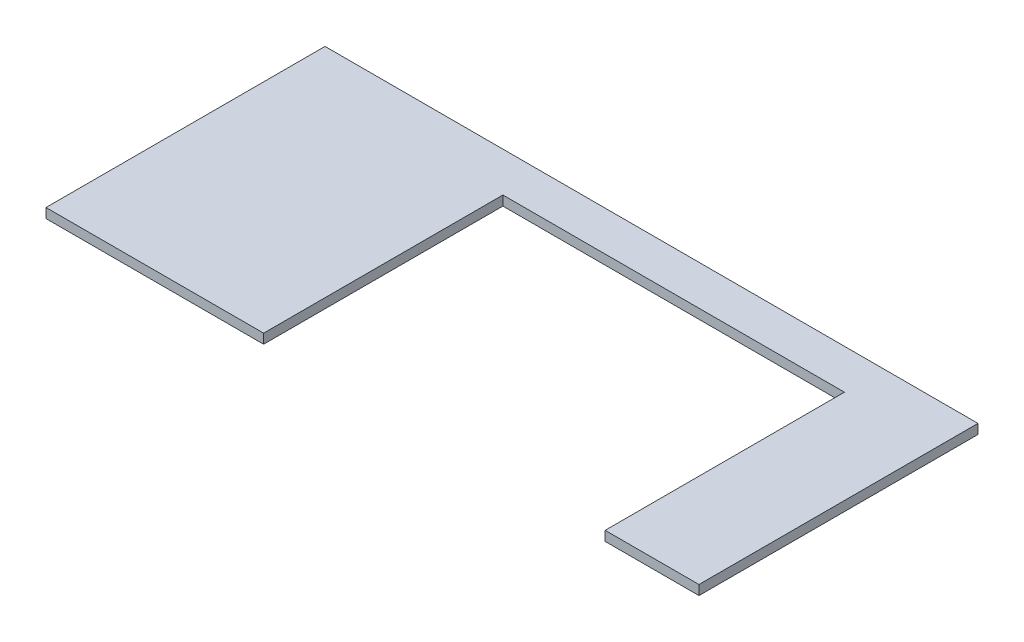
ISO-10303-21;
HEADER;
FILE_DESCRIPTION(('STEP AP214'),'2;1');
FILE_NAME('part.step','',(''),(''),'','','');
FILE_SCHEMA(('AUTOMOTIVE_DESIGN { 1 0 10303 214 1 1 1 1 }'));
ENDSEC;
DATA;
#1=APPLICATION_CONTEXT('core data for automotive mechanical design processes');
#2=APPLICATION_PROTOCOL_DEFINITION('international standard','automotive_design',2000,#1);
#3=PRODUCT_CONTEXT('',#1,'mechanical');
#4=PRODUCT('Part','Part','',(#3));
#5=PRODUCT_RELATED_PRODUCT_CATEGORY('part','',(#4));
#6=PRODUCT_DEFINITION_FORMATION('','',#4);
#7=PRODUCT_DEFINITION_CONTEXT('part definition',#1,'design');
#8=PRODUCT_DEFINITION('design','',#6,#7);
#9=PRODUCT_DEFINITION_SHAPE('','',#8);
#10=(LENGTH_UNIT() NAMED_UNIT(*) SI_UNIT(.MILLI.,.METRE.));
#11=(NAMED_UNIT(*) PLANE_ANGLE_UNIT() SI_UNIT($,.RADIAN.));
#12=(NAMED_UNIT(*) SI_UNIT($,.STERADIAN.) SOLID_ANGLE_UNIT());
#13=UNCERTAINTY_MEASURE_WITH_UNIT(LENGTH_MEASURE(1.E-05),#10,'distance_accuracy_value','');
#14=(GEOMETRIC_REPRESENTATION_CONTEXT(3) GLOBAL_UNCERTAINTY_ASSIGNED_CONTEXT((#13)) GLOBAL_UNIT_ASSIGNED_CONTEXT((#10,
#11,#12)) REPRESENTATION_CONTEXT('',''));
#15=CARTESIAN_POINT('',(0.,0.,0.));
#16=DIRECTION('',(0.,0.,1.));
#17=DIRECTION('',(1.,0.,0.));
#18=AXIS2_PLACEMENT_3D('',#15,#16,#17);
#19=CARTESIAN_POINT('',(0.,-19.05,0.));
#20=DIRECTION('',(0.,0.,1.));
#21=DIRECTION('',(1.,0.,0.));
#22=AXIS2_PLACEMENT_3D('',#19,#20,#21);
#23=PLANE('',#22);
#24=DIRECTION('',(0.,1.,0.));
#25=VECTOR('',#24,1.);
#26=CARTESIAN_POINT('',(430.8856,-19.05,0.));
#27=LINE('',#26,#25);
#28=CARTESIAN_POINT('',(430.8856,-19.05,0.));
#29=VERTEX_POINT('',#28);
#30=CARTESIAN_POINT('',(430.8856,0.,0.));
#31=VERTEX_POINT('',#30);
#32=EDGE_CURVE('E115',#29,#31,#27,.T.);
#33=ORIENTED_EDGE('',*,*,#32,.T.);
#34=DIRECTION('',(1.,0.,0.));
#35=VECTOR('',#34,1.);
#36=CARTESIAN_POINT('',(0.,0.,0.));
#37=LINE('',#36,#35);
#38=CARTESIAN_POINT('',(0.,0.,0.));
#39=VERTEX_POINT('',#38);
#40=EDGE_CURVE('E146',#39,#31,#37,.T.);
#41=ORIENTED_EDGE('',*,*,#40,.F.);
#42=DIRECTION('',(0.,1.,0.));
#43=VECTOR('',#42,1.);
#44=CARTESIAN_POINT('',(0.,-19.05,0.));
#45=LINE('',#44,#43);
#46=CARTESIAN_POINT('',(0.,-19.05,0.));
#47=VERTEX_POINT('',#46);
#48=EDGE_CURVE('E11',#47,#39,#45,.T.);
#49=ORIENTED_EDGE('',*,*,#48,.F.);
#50=DIRECTION('',(1.,0.,0.));
#51=VECTOR('',#50,1.);
#52=CARTESIAN_POINT('',(0.,-19.05,0.));
#53=LINE('',#52,#51);
#54=EDGE_CURVE('E128',#47,#29,#53,.T.);
#55=ORIENTED_EDGE('',*,*,#54,.T.);
#56=EDGE_LOOP('',(#33,#41,#49,#55));
#57=FACE_BOUND('',#56,.T.);
#58=ADVANCED_FACE('F40',(#57),#23,.T.);
#59=DIRECTION('',(0.,1.,0.));
#60=VECTOR('',#59,1.);
#61=CARTESIAN_POINT('',(1107.08694,-19.05,0.));
#62=LINE('',#61,#60);
#63=CARTESIAN_POINT('',(1107.08694,-19.05,0.));
#64=VERTEX_POINT('',#63);
#65=CARTESIAN_POINT('',(1107.08694,0.,0.));
#66=VERTEX_POINT('',#65);
#67=EDGE_CURVE('E57',#64,#66,#62,.T.);
#68=ORIENTED_EDGE('',*,*,#67,.F.);
#69=CARTESIAN_POINT('',(1292.86,-19.05,0.));
#70=VERTEX_POINT('',#69);
#71=EDGE_CURVE('E90',#64,#70,#53,.T.);
#72=ORIENTED_EDGE('',*,*,#71,.T.);
#73=DIRECTION('',(0.,1.,0.));
#74=VECTOR('',#73,1.);
#75=CARTESIAN_POINT('',(1292.86,-19.05,0.));
#76=LINE('',#75,#74);
#77=CARTESIAN_POINT('',(1292.86,0.,0.));
#78=VERTEX_POINT('',#77);
#79=EDGE_CURVE('E44',#70,#78,#76,.T.);
#80=ORIENTED_EDGE('',*,*,#79,.T.);
#81=EDGE_CURVE('E149',#66,#78,#37,.T.);
#82=ORIENTED_EDGE('',*,*,#81,.F.);
#83=EDGE_LOOP('',(#68,#72,#80,#82));
#84=FACE_BOUND('',#83,.T.);
#85=ADVANCED_FACE('F42',(#84),#23,.T.);
#86=CARTESIAN_POINT('',(0.,-19.05,-552.449999999999));
#87=DIRECTION('',(-1.,0.,0.));
#88=DIRECTION('',(0.,0.,1.));
#89=AXIS2_PLACEMENT_3D('',#86,#87,#88);
#90=PLANE('',#89);
#91=DIRECTION('',(0.,0.,1.));
#92=VECTOR('',#91,1.);
#93=CARTESIAN_POINT('',(0.,0.,-552.449999999999));
#94=LINE('',#93,#92);
#95=CARTESIAN_POINT('',(0.,0.,-552.449999999999));
#96=VERTEX_POINT('',#95);
#97=EDGE_CURVE('E139',#96,#39,#94,.T.);
#98=ORIENTED_EDGE('',*,*,#97,.F.);
#99=DIRECTION('',(0.,1.,0.));
#100=VECTOR('',#99,1.);
#101=CARTESIAN_POINT('',(0.,-19.05,-552.449999999999));
#102=LINE('',#101,#100);
#103=CARTESIAN_POINT('',(0.,-19.05,-552.449999999999));
#104=VERTEX_POINT('',#103);
#105=EDGE_CURVE('E49',#104,#96,#102,.T.);
#106=ORIENTED_EDGE('',*,*,#105,.F.);
#107=DIRECTION('',(0.,0.,1.));
#108=VECTOR('',#107,1.);
#109=CARTESIAN_POINT('',(0.,-19.05,-552.449999999999));
#110=LINE('',#109,#108);
#111=EDGE_CURVE('E144',#104,#47,#110,.T.);
#112=ORIENTED_EDGE('',*,*,#111,.T.);
#113=ORIENTED_EDGE('',*,*,#48,.T.);
#114=EDGE_LOOP('',(#98,#106,#112,#113));
#115=FACE_BOUND('',#114,.T.);
#116=ADVANCED_FACE('F181',(#115),#90,.T.);
#117=CARTESIAN_POINT('',(1292.86,-19.05,-552.45));
#118=DIRECTION('',(0.,0.,-1.));
#119=DIRECTION('',(-1.,0.,0.));
#120=AXIS2_PLACEMENT_3D('',#117,#118,#119);
#121=PLANE('',#120);
#122=DIRECTION('',(-1.,0.,0.));
#123=VECTOR('',#122,1.);
#124=CARTESIAN_POINT('',(1292.86,0.,-552.45));
#125=LINE('',#124,#123);
#126=CARTESIAN_POINT('',(1292.86,0.,-552.45));
#127=VERTEX_POINT('',#126);
#128=EDGE_CURVE('E152',#127,#96,#125,.T.);
#129=ORIENTED_EDGE('',*,*,#128,.F.);
#130=DIRECTION('',(0.,1.,0.));
#131=VECTOR('',#130,1.);
#132=CARTESIAN_POINT('',(1292.86,-19.05,-552.45));
#133=LINE('',#132,#131);
#134=CARTESIAN_POINT('',(1292.86,-19.05,-552.45));
#135=VERTEX_POINT('',#134);
#136=EDGE_CURVE('E157',#135,#127,#133,.T.);
#137=ORIENTED_EDGE('',*,*,#136,.F.);
#138=DIRECTION('',(-1.,0.,0.));
#139=VECTOR('',#138,1.);
#140=CARTESIAN_POINT('',(1292.86,-19.05,-552.45));
#141=LINE('',#140,#139);
#142=EDGE_CURVE('E137',#135,#104,#141,.T.);
#143=ORIENTED_EDGE('',*,*,#142,.T.);
#144=ORIENTED_EDGE('',*,*,#105,.T.);
#145=EDGE_LOOP('',(#129,#137,#143,#144));
#146=FACE_BOUND('',#145,.T.);
#147=ADVANCED_FACE('F184',(#146),#121,.T.);
#148=CARTESIAN_POINT('',(1292.86,-19.05,0.));
#149=DIRECTION('',(1.,0.,0.));
#150=DIRECTION('',(0.,0.,-1.));
#151=AXIS2_PLACEMENT_3D('',#148,#149,#150);
#152=PLANE('',#151);
#153=DIRECTION('',(0.,0.,-1.));
#154=VECTOR('',#153,1.);
#155=CARTESIAN_POINT('',(1292.86,0.,0.));
#156=LINE('',#155,#154);
#157=EDGE_CURVE('E148',#78,#127,#156,.T.);
#158=ORIENTED_EDGE('',*,*,#157,.F.);
#159=ORIENTED_EDGE('',*,*,#79,.F.);
#160=DIRECTION('',(0.,0.,-1.));
#161=VECTOR('',#160,1.);
#162=CARTESIAN_POINT('',(1292.86,-19.05,0.));
#163=LINE('',#162,#161);
#164=EDGE_CURVE('E134',#70,#135,#163,.T.);
#165=ORIENTED_EDGE('',*,*,#164,.T.);
#166=ORIENTED_EDGE('',*,*,#136,.T.);
#167=EDGE_LOOP('',(#158,#159,#165,#166));
#168=FACE_BOUND('',#167,.T.);
#169=ADVANCED_FACE('F163',(#168),#152,.T.);
#170=CARTESIAN_POINT('',(0.,-19.05,0.));
#171=DIRECTION('',(0.,1.,0.));
#172=DIRECTION('',(0.,0.,1.));
#173=AXIS2_PLACEMENT_3D('',#170,#171,#172);
#174=PLANE('',#173);
#175=DIRECTION('',(-1.,0.,0.));
#176=VECTOR('',#175,1.);
#177=CARTESIAN_POINT('',(430.8856,-19.05,-473.71));
#178=LINE('',#177,#176);
#179=CARTESIAN_POINT('',(1107.08694,-19.05,-473.71));
#180=VERTEX_POINT('',#179);
#181=CARTESIAN_POINT('',(430.8856,-19.05,-473.71));
#182=VERTEX_POINT('',#181);
#183=EDGE_CURVE('E123',#180,#182,#178,.T.);
#184=ORIENTED_EDGE('',*,*,#183,.T.);
#185=DIRECTION('',(0.,0.,1.));
#186=VECTOR('',#185,1.);
#187=CARTESIAN_POINT('',(430.8856,-19.05,-473.71));
#188=LINE('',#187,#186);
#189=EDGE_CURVE('E118',#182,#29,#188,.T.);
#190=ORIENTED_EDGE('',*,*,#189,.T.);
#191=ORIENTED_EDGE('',*,*,#54,.F.);
#192=ORIENTED_EDGE('',*,*,#111,.F.);
#193=ORIENTED_EDGE('',*,*,#142,.F.);
#194=ORIENTED_EDGE('',*,*,#164,.F.);
#195=ORIENTED_EDGE('',*,*,#71,.F.);
#196=DIRECTION('',(0.,0.,-1.));
#197=VECTOR('',#196,1.);
#198=CARTESIAN_POINT('',(1107.08694,-19.05,-473.71));
#199=LINE('',#198,#197);
#200=EDGE_CURVE('E131',#64,#180,#199,.T.);
#201=ORIENTED_EDGE('',*,*,#200,.T.);
#202=EDGE_LOOP('',(#184,#190,#191,#192,#193,#194,#195,#201));
#203=FACE_BOUND('',#202,.T.);
#204=ADVANCED_FACE('F126',(#203),#174,.F.);
#205=CARTESIAN_POINT('',(0.,0.,0.));
#206=DIRECTION('',(0.,1.,0.));
#207=DIRECTION('',(0.,0.,1.));
#208=AXIS2_PLACEMENT_3D('',#205,#206,#207);
#209=PLANE('',#208);
#210=DIRECTION('',(0.,0.,1.));
#211=VECTOR('',#210,1.);
#212=CARTESIAN_POINT('',(430.8856,0.,-473.71));
#213=LINE('',#212,#211);
#214=CARTESIAN_POINT('',(430.8856,0.,-473.71));
#215=VERTEX_POINT('',#214);
#216=EDGE_CURVE('E121',#215,#31,#213,.T.);
#217=ORIENTED_EDGE('',*,*,#216,.F.);
#218=DIRECTION('',(-1.,0.,0.));
#219=VECTOR('',#218,1.);
#220=CARTESIAN_POINT('',(430.8856,0.,-473.71));
#221=LINE('',#220,#219);
#222=CARTESIAN_POINT('',(1107.08694,0.,-473.71));
#223=VERTEX_POINT('',#222);
#224=EDGE_CURVE('E132',#223,#215,#221,.T.);
#225=ORIENTED_EDGE('',*,*,#224,.F.);
#226=DIRECTION('',(0.,0.,-1.));
#227=VECTOR('',#226,1.);
#228=CARTESIAN_POINT('',(1107.08694,0.,-473.71));
#229=LINE('',#228,#227);
#230=EDGE_CURVE('E167',#66,#223,#229,.T.);
#231=ORIENTED_EDGE('',*,*,#230,.F.);
#232=ORIENTED_EDGE('',*,*,#81,.T.);
#233=ORIENTED_EDGE('',*,*,#157,.T.);
#234=ORIENTED_EDGE('',*,*,#128,.T.);
#235=ORIENTED_EDGE('',*,*,#97,.T.);
#236=ORIENTED_EDGE('',*,*,#40,.T.);
#237=EDGE_LOOP('',(#217,#225,#231,#232,#233,#234,#235,#236));
#238=FACE_BOUND('',#237,.T.);
#239=ADVANCED_FACE('F165',(#238),#209,.T.);
#240=CARTESIAN_POINT('',(430.8856,-19.05,-473.71));
#241=DIRECTION('',(-1.,0.,0.));
#242=DIRECTION('',(0.,0.,1.));
#243=AXIS2_PLACEMENT_3D('',#240,#241,#242);
#244=PLANE('',#243);
#245=ORIENTED_EDGE('',*,*,#216,.T.);
#246=ORIENTED_EDGE('',*,*,#32,.F.);
#247=ORIENTED_EDGE('',*,*,#189,.F.);
#248=DIRECTION('',(0.,1.,0.));
#249=VECTOR('',#248,1.);
#250=CARTESIAN_POINT('',(430.8856,-19.05,-473.71));
#251=LINE('',#250,#249);
#252=EDGE_CURVE('E168',#182,#215,#251,.T.);
#253=ORIENTED_EDGE('',*,*,#252,.T.);
#254=EDGE_LOOP('',(#245,#246,#247,#253));
#255=FACE_BOUND('',#254,.T.);
#256=ADVANCED_FACE('F117',(#255),#244,.F.);
#257=CARTESIAN_POINT('',(430.8856,-19.05,-473.71));
#258=DIRECTION('',(0.,0.,-1.));
#259=DIRECTION('',(-1.,0.,0.));
#260=AXIS2_PLACEMENT_3D('',#257,#258,#259);
#261=PLANE('',#260);
#262=ORIENTED_EDGE('',*,*,#224,.T.);
#263=ORIENTED_EDGE('',*,*,#252,.F.);
#264=ORIENTED_EDGE('',*,*,#183,.F.);
#265=DIRECTION('',(0.,1.,0.));
#266=VECTOR('',#265,1.);
#267=CARTESIAN_POINT('',(1107.08694,-19.05,-473.71));
#268=LINE('',#267,#266);
#269=EDGE_CURVE('E169',#180,#223,#268,.T.);
#270=ORIENTED_EDGE('',*,*,#269,.T.);
#271=EDGE_LOOP('',(#262,#263,#264,#270));
#272=FACE_BOUND('',#271,.T.);
#273=ADVANCED_FACE('F180',(#272),#261,.F.);
#274=CARTESIAN_POINT('',(1107.08694,-19.05,-473.71));
#275=DIRECTION('',(1.,0.,0.));
#276=DIRECTION('',(0.,0.,-1.));
#277=AXIS2_PLACEMENT_3D('',#274,#275,#276);
#278=PLANE('',#277);
#279=ORIENTED_EDGE('',*,*,#230,.T.);
#280=ORIENTED_EDGE('',*,*,#269,.F.);
#281=ORIENTED_EDGE('',*,*,#200,.F.);
#282=ORIENTED_EDGE('',*,*,#67,.T.);
#283=EDGE_LOOP('',(#279,#280,#281,#282));
#284=FACE_BOUND('',#283,.T.);
#285=ADVANCED_FACE('F178',(#284),#278,.F.);
#286=CLOSED_SHELL('',(#58,#85,#116,#147,#169,#204,#239,#256,#273,#285));
#287=MANIFOLD_SOLID_BREP('B2',#286);
#288=ADVANCED_BREP_SHAPE_REPRESENTATION('',(#18,#287),#14);
#289=SHAPE_DEFINITION_REPRESENTATION(#9,#288);
ENDSEC;
END-ISO-10303-21;
